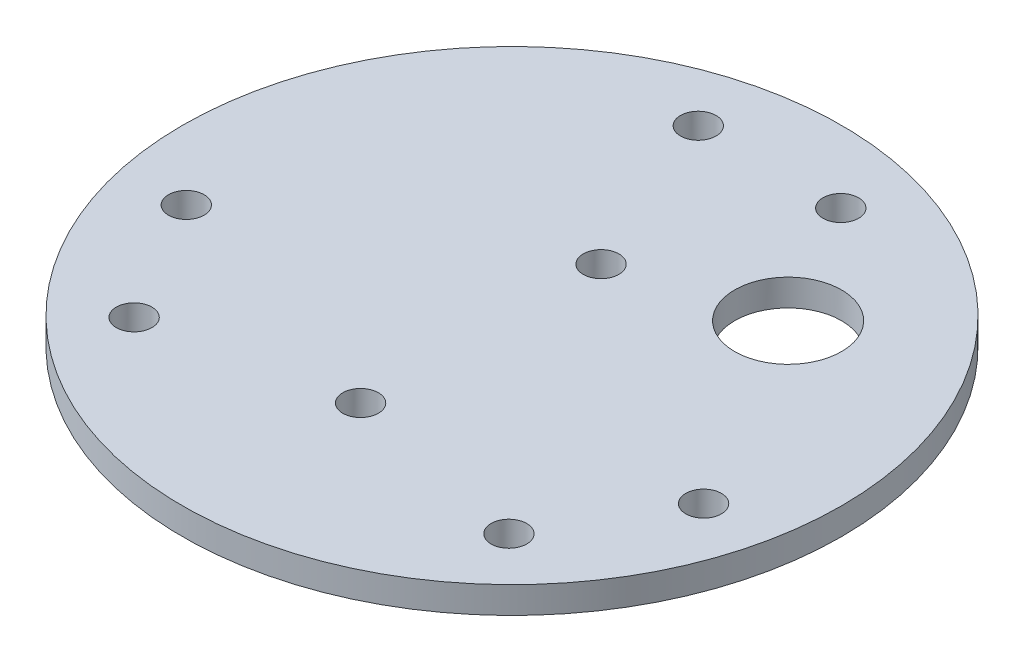
ISO-10303-21;
HEADER;
FILE_DESCRIPTION(('STEP AP214'),'2;1');
FILE_NAME('part.step','',(''),(''),'','','');
FILE_SCHEMA(('AUTOMOTIVE_DESIGN { 1 0 10303 214 1 1 1 1 }'));
ENDSEC;
DATA;
#1=APPLICATION_CONTEXT('core data for automotive mechanical design processes');
#2=APPLICATION_PROTOCOL_DEFINITION('international standard','automotive_design',2000,#1);
#3=PRODUCT_CONTEXT('',#1,'mechanical');
#4=PRODUCT('Part','Part','',(#3));
#5=PRODUCT_RELATED_PRODUCT_CATEGORY('part','',(#4));
#6=PRODUCT_DEFINITION_FORMATION('','',#4);
#7=PRODUCT_DEFINITION_CONTEXT('part definition',#1,'design');
#8=PRODUCT_DEFINITION('design','',#6,#7);
#9=PRODUCT_DEFINITION_SHAPE('','',#8);
#10=(LENGTH_UNIT() NAMED_UNIT(*) SI_UNIT(.MILLI.,.METRE.));
#11=(NAMED_UNIT(*) PLANE_ANGLE_UNIT() SI_UNIT($,.RADIAN.));
#12=(NAMED_UNIT(*) SI_UNIT($,.STERADIAN.) SOLID_ANGLE_UNIT());
#13=UNCERTAINTY_MEASURE_WITH_UNIT(LENGTH_MEASURE(1.E-05),#10,'distance_accuracy_value','');
#14=(GEOMETRIC_REPRESENTATION_CONTEXT(3) GLOBAL_UNCERTAINTY_ASSIGNED_CONTEXT((#13)) GLOBAL_UNIT_ASSIGNED_CONTEXT((#10,
#11,#12)) REPRESENTATION_CONTEXT('',''));
#15=CARTESIAN_POINT('',(0.,0.,0.));
#16=DIRECTION('',(0.,0.,1.));
#17=DIRECTION('',(1.,0.,0.));
#18=AXIS2_PLACEMENT_3D('',#15,#16,#17);
#19=CARTESIAN_POINT('',(0.,2.,0.));
#20=DIRECTION('',(0.,1.,0.));
#21=DIRECTION('',(1.,0.,0.));
#22=AXIS2_PLACEMENT_3D('',#19,#20,#21);
#23=PLANE('',#22);
#24=CARTESIAN_POINT('',(0.,2.,17.));
#25=DIRECTION('',(0.,1.,0.));
#26=DIRECTION('',(0.,0.,1.));
#27=AXIS2_PLACEMENT_3D('',#24,#25,#26);
#28=CIRCLE('',#27,2.);
#29=CARTESIAN_POINT('',(0.,2.,19.));
#30=VERTEX_POINT('',#29);
#31=EDGE_CURVE('E82',#30,#30,#28,.T.);
#32=ORIENTED_EDGE('',*,*,#31,.F.);
#33=EDGE_LOOP('',(#32));
#34=FACE_BOUND('',#33,.T.);
#35=CARTESIAN_POINT('',(0.,2.,-10.));
#36=DIRECTION('',(0.,1.,0.));
#37=DIRECTION('',(0.,0.,1.));
#38=AXIS2_PLACEMENT_3D('',#35,#36,#37);
#39=CIRCLE('',#38,2.);
#40=CARTESIAN_POINT('',(0.,2.,-8.));
#41=VERTEX_POINT('',#40);
#42=EDGE_CURVE('E89',#41,#41,#39,.T.);
#43=ORIENTED_EDGE('',*,*,#42,.F.);
#44=EDGE_LOOP('',(#43));
#45=FACE_BOUND('',#44,.T.);
#46=CARTESIAN_POINT('',(-29.0399680510976,2.,7.52862906452533));
#47=DIRECTION('',(0.,1.,0.));
#48=DIRECTION('',(0.,0.,-1.));
#49=AXIS2_PLACEMENT_3D('',#46,#47,#48);
#50=CIRCLE('',#49,2.);
#51=CARTESIAN_POINT('',(-29.0399680510976,2.,5.52862906452533));
#52=VERTEX_POINT('',#51);
#53=EDGE_CURVE('E131',#52,#52,#50,.T.);
#54=ORIENTED_EDGE('',*,*,#53,.F.);
#55=EDGE_LOOP('',(#54));
#56=FACE_BOUND('',#55,.T.);
#57=CARTESIAN_POINT('',(-21.0399680510976,2.,21.3850355250763));
#58=DIRECTION('',(0.,1.,0.));
#59=DIRECTION('',(0.,0.,1.));
#60=AXIS2_PLACEMENT_3D('',#57,#58,#59);
#61=CIRCLE('',#60,2.);
#62=CARTESIAN_POINT('',(-21.0399680510976,2.,23.3850355250763));
#63=VERTEX_POINT('',#62);
#64=EDGE_CURVE('E125',#63,#63,#61,.T.);
#65=ORIENTED_EDGE('',*,*,#64,.F.);
#66=EDGE_LOOP('',(#65));
#67=FACE_BOUND('',#66,.T.);
#68=CARTESIAN_POINT('',(21.0399680510976,2.,21.3850355250763));
#69=DIRECTION('',(0.,1.,0.));
#70=DIRECTION('',(0.,0.,-1.));
#71=AXIS2_PLACEMENT_3D('',#68,#69,#70);
#72=CIRCLE('',#71,2.00000000000001);
#73=CARTESIAN_POINT('',(21.0399680510976,2.,19.3850355250763));
#74=VERTEX_POINT('',#73);
#75=EDGE_CURVE('E119',#74,#74,#72,.T.);
#76=ORIENTED_EDGE('',*,*,#75,.F.);
#77=EDGE_LOOP('',(#76));
#78=FACE_BOUND('',#77,.T.);
#79=CARTESIAN_POINT('',(29.0399680510976,2.,7.52862906452531));
#80=DIRECTION('',(0.,1.,0.));
#81=DIRECTION('',(0.,0.,1.));
#82=AXIS2_PLACEMENT_3D('',#79,#80,#81);
#83=CIRCLE('',#82,2.00000000000001);
#84=CARTESIAN_POINT('',(29.0399680510976,2.,9.52862906452532));
#85=VERTEX_POINT('',#84);
#86=EDGE_CURVE('E112',#85,#85,#83,.T.);
#87=ORIENTED_EDGE('',*,*,#86,.F.);
#88=EDGE_LOOP('',(#87));
#89=FACE_BOUND('',#88,.T.);
#90=CARTESIAN_POINT('',(16.,2.,-15.));
#91=DIRECTION('',(0.,1.,0.));
#92=DIRECTION('',(0.,0.,1.));
#93=AXIS2_PLACEMENT_3D('',#90,#91,#92);
#94=CIRCLE('',#93,6.);
#95=CARTESIAN_POINT('',(16.,2.,-9.));
#96=VERTEX_POINT('',#95);
#97=EDGE_CURVE('E105',#96,#96,#94,.T.);
#98=ORIENTED_EDGE('',*,*,#97,.F.);
#99=EDGE_LOOP('',(#98));
#100=FACE_BOUND('',#99,.T.);
#101=CARTESIAN_POINT('',(8.,2.,-28.9136645896017));
#102=DIRECTION('',(0.,1.,0.));
#103=DIRECTION('',(0.,0.,-1.));
#104=AXIS2_PLACEMENT_3D('',#101,#102,#103);
#105=CIRCLE('',#104,2.);
#106=CARTESIAN_POINT('',(8.,2.,-30.9136645896017));
#107=VERTEX_POINT('',#106);
#108=EDGE_CURVE('E99',#107,#107,#105,.T.);
#109=ORIENTED_EDGE('',*,*,#108,.F.);
#110=EDGE_LOOP('',(#109));
#111=FACE_BOUND('',#110,.T.);
#112=CARTESIAN_POINT('',(-8.,2.,-28.9136645896017));
#113=DIRECTION('',(0.,1.,0.));
#114=DIRECTION('',(0.,0.,1.));
#115=AXIS2_PLACEMENT_3D('',#112,#113,#114);
#116=CIRCLE('',#115,2.);
#117=CARTESIAN_POINT('',(-8.,2.,-26.9136645896017));
#118=VERTEX_POINT('',#117);
#119=EDGE_CURVE('E71',#118,#118,#116,.T.);
#120=ORIENTED_EDGE('',*,*,#119,.F.);
#121=EDGE_LOOP('',(#120));
#122=FACE_BOUND('',#121,.T.);
#123=CARTESIAN_POINT('',(0.,2.,0.));
#124=DIRECTION('',(0.,-1.,0.));
#125=DIRECTION('',(-1.,0.,0.));
#126=AXIS2_PLACEMENT_3D('',#123,#124,#125);
#127=CIRCLE('',#126,37.);
#128=CARTESIAN_POINT('',(-37.,2.,0.));
#129=VERTEX_POINT('',#128);
#130=EDGE_CURVE('E12',#129,#129,#127,.T.);
#131=ORIENTED_EDGE('',*,*,#130,.F.);
#132=EDGE_LOOP('',(#131));
#133=FACE_BOUND('',#132,.T.);
#134=ADVANCED_FACE('F49',(#34,#45,#56,#67,#78,#89,#100,#111,#122,#133),#23,.T.);
#135=CARTESIAN_POINT('',(0.,1.,0.));
#136=DIRECTION('',(0.,1.,0.));
#137=DIRECTION('',(0.,0.,1.));
#138=AXIS2_PLACEMENT_3D('',#135,#136,#137);
#139=CYLINDRICAL_SURFACE('',#138,37.);
#140=CARTESIAN_POINT('',(0.,-1.,0.));
#141=DIRECTION('',(0.,-1.,0.));
#142=DIRECTION('',(0.,0.,-1.));
#143=AXIS2_PLACEMENT_3D('',#140,#141,#142);
#144=CIRCLE('',#143,37.);
#145=CARTESIAN_POINT('',(-37.,-1.,0.));
#146=VERTEX_POINT('',#145);
#147=EDGE_CURVE('E60',#146,#146,#144,.T.);
#148=ORIENTED_EDGE('',*,*,#147,.F.);
#149=EDGE_LOOP('',(#148));
#150=FACE_BOUND('',#149,.T.);
#151=ORIENTED_EDGE('',*,*,#130,.T.);
#152=EDGE_LOOP('',(#151));
#153=FACE_BOUND('',#152,.T.);
#154=ADVANCED_FACE('F67',(#150,#153),#139,.T.);
#155=CARTESIAN_POINT('',(0.,-1.,0.));
#156=DIRECTION('',(0.,-1.,0.));
#157=DIRECTION('',(0.,0.,-1.));
#158=AXIS2_PLACEMENT_3D('',#155,#156,#157);
#159=PLANE('',#158);
#160=CARTESIAN_POINT('',(0.,-1.,17.));
#161=DIRECTION('',(0.,-1.,0.));
#162=DIRECTION('',(0.,0.,-1.));
#163=AXIS2_PLACEMENT_3D('',#160,#161,#162);
#164=CIRCLE('',#163,2.);
#165=CARTESIAN_POINT('',(0.,-1.,15.));
#166=VERTEX_POINT('',#165);
#167=EDGE_CURVE('E53',#166,#166,#164,.T.);
#168=ORIENTED_EDGE('',*,*,#167,.F.);
#169=EDGE_LOOP('',(#168));
#170=FACE_BOUND('',#169,.T.);
#171=CARTESIAN_POINT('',(0.,-1.,-10.));
#172=DIRECTION('',(0.,-1.,0.));
#173=DIRECTION('',(0.,0.,-1.));
#174=AXIS2_PLACEMENT_3D('',#171,#172,#173);
#175=CIRCLE('',#174,2.);
#176=CARTESIAN_POINT('',(0.,-1.,-12.));
#177=VERTEX_POINT('',#176);
#178=EDGE_CURVE('E80',#177,#177,#175,.T.);
#179=ORIENTED_EDGE('',*,*,#178,.F.);
#180=EDGE_LOOP('',(#179));
#181=FACE_BOUND('',#180,.T.);
#182=CARTESIAN_POINT('',(-29.0399680510976,-1.,7.52862906452533));
#183=DIRECTION('',(0.,-1.,0.));
#184=DIRECTION('',(0.,0.,-1.));
#185=AXIS2_PLACEMENT_3D('',#182,#183,#184);
#186=CIRCLE('',#185,2.);
#187=CARTESIAN_POINT('',(-29.0399680510976,-1.,5.52862906452533));
#188=VERTEX_POINT('',#187);
#189=EDGE_CURVE('E86',#188,#188,#186,.F.);
#190=ORIENTED_EDGE('',*,*,#189,.T.);
#191=EDGE_LOOP('',(#190));
#192=FACE_BOUND('',#191,.T.);
#193=CARTESIAN_POINT('',(-21.0399680510976,-1.,21.3850355250763));
#194=DIRECTION('',(0.,-1.,0.));
#195=DIRECTION('',(0.,0.,-1.));
#196=AXIS2_PLACEMENT_3D('',#193,#194,#195);
#197=CIRCLE('',#196,2.);
#198=CARTESIAN_POINT('',(-21.0399680510976,-1.,19.3850355250763));
#199=VERTEX_POINT('',#198);
#200=EDGE_CURVE('E128',#199,#199,#197,.F.);
#201=ORIENTED_EDGE('',*,*,#200,.T.);
#202=EDGE_LOOP('',(#201));
#203=FACE_BOUND('',#202,.T.);
#204=CARTESIAN_POINT('',(21.0399680510976,-1.,21.3850355250763));
#205=DIRECTION('',(0.,-1.,0.));
#206=DIRECTION('',(0.,0.,-1.));
#207=AXIS2_PLACEMENT_3D('',#204,#205,#206);
#208=CIRCLE('',#207,2.00000000000001);
#209=CARTESIAN_POINT('',(21.0399680510976,-1.,19.3850355250763));
#210=VERTEX_POINT('',#209);
#211=EDGE_CURVE('E122',#210,#210,#208,.F.);
#212=ORIENTED_EDGE('',*,*,#211,.T.);
#213=EDGE_LOOP('',(#212));
#214=FACE_BOUND('',#213,.T.);
#215=CARTESIAN_POINT('',(29.0399680510976,-1.,7.52862906452531));
#216=DIRECTION('',(0.,-1.,0.));
#217=DIRECTION('',(0.,0.,-1.));
#218=AXIS2_PLACEMENT_3D('',#215,#216,#217);
#219=CIRCLE('',#218,2.00000000000001);
#220=CARTESIAN_POINT('',(29.0399680510976,-1.,5.52862906452531));
#221=VERTEX_POINT('',#220);
#222=EDGE_CURVE('E116',#221,#221,#219,.F.);
#223=ORIENTED_EDGE('',*,*,#222,.T.);
#224=EDGE_LOOP('',(#223));
#225=FACE_BOUND('',#224,.T.);
#226=CARTESIAN_POINT('',(16.,-1.,-15.));
#227=DIRECTION('',(0.,-1.,0.));
#228=DIRECTION('',(0.,0.,-1.));
#229=AXIS2_PLACEMENT_3D('',#226,#227,#228);
#230=CIRCLE('',#229,6.);
#231=CARTESIAN_POINT('',(16.,-1.,-21.));
#232=VERTEX_POINT('',#231);
#233=EDGE_CURVE('E109',#232,#232,#230,.F.);
#234=ORIENTED_EDGE('',*,*,#233,.T.);
#235=EDGE_LOOP('',(#234));
#236=FACE_BOUND('',#235,.T.);
#237=CARTESIAN_POINT('',(8.,-1.,-28.9136645896017));
#238=DIRECTION('',(0.,-1.,0.));
#239=DIRECTION('',(0.,0.,-1.));
#240=AXIS2_PLACEMENT_3D('',#237,#238,#239);
#241=CIRCLE('',#240,2.);
#242=CARTESIAN_POINT('',(8.,-1.,-30.9136645896017));
#243=VERTEX_POINT('',#242);
#244=EDGE_CURVE('E102',#243,#243,#241,.F.);
#245=ORIENTED_EDGE('',*,*,#244,.T.);
#246=EDGE_LOOP('',(#245));
#247=FACE_BOUND('',#246,.T.);
#248=CARTESIAN_POINT('',(-8.,-1.,-28.9136645896017));
#249=DIRECTION('',(0.,-1.,0.));
#250=DIRECTION('',(0.,0.,-1.));
#251=AXIS2_PLACEMENT_3D('',#248,#249,#250);
#252=CIRCLE('',#251,2.);
#253=CARTESIAN_POINT('',(-8.,-1.,-30.9136645896017));
#254=VERTEX_POINT('',#253);
#255=EDGE_CURVE('E77',#254,#254,#252,.F.);
#256=ORIENTED_EDGE('',*,*,#255,.T.);
#257=EDGE_LOOP('',(#256));
#258=FACE_BOUND('',#257,.T.);
#259=ORIENTED_EDGE('',*,*,#147,.T.);
#260=EDGE_LOOP('',(#259));
#261=FACE_BOUND('',#260,.T.);
#262=ADVANCED_FACE('F51',(#170,#181,#192,#203,#214,#225,#236,#247,#258,#261),#159,.T.);
#263=CARTESIAN_POINT('',(-8.,-1.001,-28.9136645896017));
#264=DIRECTION('',(0.,1.,0.));
#265=DIRECTION('',(0.,0.,1.));
#266=AXIS2_PLACEMENT_3D('',#263,#264,#265);
#267=CYLINDRICAL_SURFACE('',#266,2.);
#268=ORIENTED_EDGE('',*,*,#255,.F.);
#269=EDGE_LOOP('',(#268));
#270=FACE_BOUND('',#269,.T.);
#271=ORIENTED_EDGE('',*,*,#119,.T.);
#272=EDGE_LOOP('',(#271));
#273=FACE_BOUND('',#272,.T.);
#274=ADVANCED_FACE('F139',(#270,#273),#267,.F.);
#275=CARTESIAN_POINT('',(8.,-1.001,-28.9136645896017));
#276=DIRECTION('',(0.,1.,0.));
#277=DIRECTION('',(0.,0.,1.));
#278=AXIS2_PLACEMENT_3D('',#275,#276,#277);
#279=CYLINDRICAL_SURFACE('',#278,2.);
#280=ORIENTED_EDGE('',*,*,#244,.F.);
#281=EDGE_LOOP('',(#280));
#282=FACE_BOUND('',#281,.T.);
#283=ORIENTED_EDGE('',*,*,#108,.T.);
#284=EDGE_LOOP('',(#283));
#285=FACE_BOUND('',#284,.T.);
#286=ADVANCED_FACE('F142',(#282,#285),#279,.F.);
#287=CARTESIAN_POINT('',(16.,-1.001,-15.));
#288=DIRECTION('',(0.,1.,0.));
#289=DIRECTION('',(0.,0.,1.));
#290=AXIS2_PLACEMENT_3D('',#287,#288,#289);
#291=CYLINDRICAL_SURFACE('',#290,6.);
#292=ORIENTED_EDGE('',*,*,#233,.F.);
#293=EDGE_LOOP('',(#292));
#294=FACE_BOUND('',#293,.T.);
#295=ORIENTED_EDGE('',*,*,#97,.T.);
#296=EDGE_LOOP('',(#295));
#297=FACE_BOUND('',#296,.T.);
#298=ADVANCED_FACE('F170',(#294,#297),#291,.F.);
#299=CARTESIAN_POINT('',(29.0399680510976,-1.001,7.52862906452531));
#300=DIRECTION('',(0.,1.,0.));
#301=DIRECTION('',(0.,0.,1.));
#302=AXIS2_PLACEMENT_3D('',#299,#300,#301);
#303=CYLINDRICAL_SURFACE('',#302,2.00000000000001);
#304=ORIENTED_EDGE('',*,*,#222,.F.);
#305=EDGE_LOOP('',(#304));
#306=FACE_BOUND('',#305,.T.);
#307=ORIENTED_EDGE('',*,*,#86,.T.);
#308=EDGE_LOOP('',(#307));
#309=FACE_BOUND('',#308,.T.);
#310=ADVANCED_FACE('F166',(#306,#309),#303,.F.);
#311=CARTESIAN_POINT('',(21.0399680510976,-1.001,21.3850355250763));
#312=DIRECTION('',(0.,1.,0.));
#313=DIRECTION('',(0.,0.,1.));
#314=AXIS2_PLACEMENT_3D('',#311,#312,#313);
#315=CYLINDRICAL_SURFACE('',#314,2.00000000000001);
#316=ORIENTED_EDGE('',*,*,#211,.F.);
#317=EDGE_LOOP('',(#316));
#318=FACE_BOUND('',#317,.T.);
#319=ORIENTED_EDGE('',*,*,#75,.T.);
#320=EDGE_LOOP('',(#319));
#321=FACE_BOUND('',#320,.T.);
#322=ADVANCED_FACE('F162',(#318,#321),#315,.F.);
#323=CARTESIAN_POINT('',(-21.0399680510976,-1.001,21.3850355250763));
#324=DIRECTION('',(0.,1.,0.));
#325=DIRECTION('',(0.,0.,1.));
#326=AXIS2_PLACEMENT_3D('',#323,#324,#325);
#327=CYLINDRICAL_SURFACE('',#326,2.);
#328=ORIENTED_EDGE('',*,*,#200,.F.);
#329=EDGE_LOOP('',(#328));
#330=FACE_BOUND('',#329,.T.);
#331=ORIENTED_EDGE('',*,*,#64,.T.);
#332=EDGE_LOOP('',(#331));
#333=FACE_BOUND('',#332,.T.);
#334=ADVANCED_FACE('F158',(#330,#333),#327,.F.);
#335=CARTESIAN_POINT('',(-29.0399680510976,-1.001,7.52862906452533));
#336=DIRECTION('',(0.,1.,0.));
#337=DIRECTION('',(0.,0.,1.));
#338=AXIS2_PLACEMENT_3D('',#335,#336,#337);
#339=CYLINDRICAL_SURFACE('',#338,2.);
#340=ORIENTED_EDGE('',*,*,#189,.F.);
#341=EDGE_LOOP('',(#340));
#342=FACE_BOUND('',#341,.T.);
#343=ORIENTED_EDGE('',*,*,#53,.T.);
#344=EDGE_LOOP('',(#343));
#345=FACE_BOUND('',#344,.T.);
#346=ADVANCED_FACE('F154',(#342,#345),#339,.F.);
#347=CARTESIAN_POINT('',(0.,-3.,-10.));
#348=DIRECTION('',(0.,1.,0.));
#349=DIRECTION('',(0.,0.,1.));
#350=AXIS2_PLACEMENT_3D('',#347,#348,#349);
#351=CYLINDRICAL_SURFACE('',#350,2.);
#352=ORIENTED_EDGE('',*,*,#178,.T.);
#353=EDGE_LOOP('',(#352));
#354=FACE_BOUND('',#353,.T.);
#355=ORIENTED_EDGE('',*,*,#42,.T.);
#356=EDGE_LOOP('',(#355));
#357=FACE_BOUND('',#356,.T.);
#358=ADVANCED_FACE('F157',(#354,#357),#351,.F.);
#359=CARTESIAN_POINT('',(0.,-3.,17.));
#360=DIRECTION('',(0.,1.,0.));
#361=DIRECTION('',(0.,0.,1.));
#362=AXIS2_PLACEMENT_3D('',#359,#360,#361);
#363=CYLINDRICAL_SURFACE('',#362,2.);
#364=ORIENTED_EDGE('',*,*,#167,.T.);
#365=EDGE_LOOP('',(#364));
#366=FACE_BOUND('',#365,.T.);
#367=ORIENTED_EDGE('',*,*,#31,.T.);
#368=EDGE_LOOP('',(#367));
#369=FACE_BOUND('',#368,.T.);
#370=ADVANCED_FACE('F180',(#366,#369),#363,.F.);
#371=CLOSED_SHELL('',(#134,#154,#262,#274,#286,#298,#310,#322,#334,#346,#358,#370));
#372=MANIFOLD_SOLID_BREP('B2',#371);
#373=ADVANCED_BREP_SHAPE_REPRESENTATION('',(#18,#372),#14);
#374=SHAPE_DEFINITION_REPRESENTATION(#9,#373);
ENDSEC;
END-ISO-10303-21;
